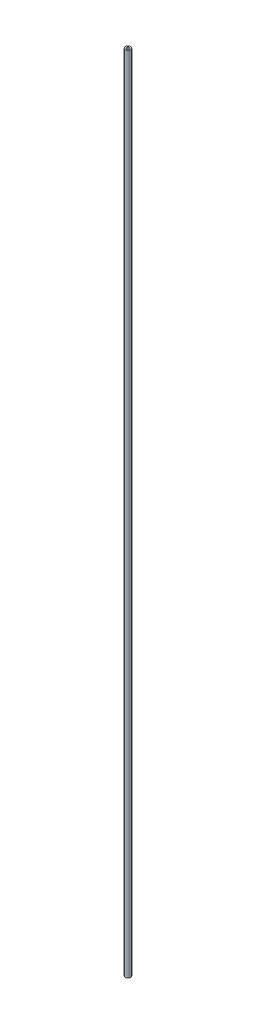
ISO-10303-21;
HEADER;
FILE_DESCRIPTION(('STEP AP214'),'2;1');
FILE_NAME('part.step','',(''),(''),'','','');
FILE_SCHEMA(('AUTOMOTIVE_DESIGN { 1 0 10303 214 1 1 1 1 }'));
ENDSEC;
DATA;
#1=APPLICATION_CONTEXT('core data for automotive mechanical design processes');
#2=APPLICATION_PROTOCOL_DEFINITION('international standard','automotive_design',2000,#1);
#3=PRODUCT_CONTEXT('',#1,'mechanical');
#4=PRODUCT('Part','Part','',(#3));
#5=PRODUCT_RELATED_PRODUCT_CATEGORY('part','',(#4));
#6=PRODUCT_DEFINITION_FORMATION('','',#4);
#7=PRODUCT_DEFINITION_CONTEXT('part definition',#1,'design');
#8=PRODUCT_DEFINITION('design','',#6,#7);
#9=PRODUCT_DEFINITION_SHAPE('','',#8);
#10=(LENGTH_UNIT() NAMED_UNIT(*) SI_UNIT(.MILLI.,.METRE.));
#11=(NAMED_UNIT(*) PLANE_ANGLE_UNIT() SI_UNIT($,.RADIAN.));
#12=(NAMED_UNIT(*) SI_UNIT($,.STERADIAN.) SOLID_ANGLE_UNIT());
#13=UNCERTAINTY_MEASURE_WITH_UNIT(LENGTH_MEASURE(1.E-05),#10,'distance_accuracy_value','');
#14=(GEOMETRIC_REPRESENTATION_CONTEXT(3) GLOBAL_UNCERTAINTY_ASSIGNED_CONTEXT((#13)) GLOBAL_UNIT_ASSIGNED_CONTEXT((#10,
#11,#12)) REPRESENTATION_CONTEXT('',''));
#15=CARTESIAN_POINT('',(0.,0.,0.));
#16=DIRECTION('',(0.,0.,1.));
#17=DIRECTION('',(1.,0.,0.));
#18=AXIS2_PLACEMENT_3D('',#15,#16,#17);
#19=CARTESIAN_POINT('',(0.,-150.,0.));
#20=DIRECTION('',(0.,1.,0.));
#21=DIRECTION('',(0.,0.,1.));
#22=AXIS2_PLACEMENT_3D('',#19,#20,#21);
#23=CYLINDRICAL_SURFACE('',#22,1.);
#24=CARTESIAN_POINT('',(0.,-150.,0.));
#25=DIRECTION('',(0.,1.,0.));
#26=DIRECTION('',(0.,0.,1.));
#27=AXIS2_PLACEMENT_3D('',#24,#25,#26);
#28=CIRCLE('',#27,1.);
#29=CARTESIAN_POINT('',(0.,-150.,1.));
#30=VERTEX_POINT('',#29);
#31=EDGE_CURVE('E10',#30,#30,#28,.T.);
#32=ORIENTED_EDGE('',*,*,#31,.T.);
#33=EDGE_LOOP('',(#32));
#34=FACE_BOUND('',#33,.T.);
#35=CARTESIAN_POINT('',(0.,150.,0.));
#36=DIRECTION('',(0.,1.,0.));
#37=DIRECTION('',(0.,0.,1.));
#38=AXIS2_PLACEMENT_3D('',#35,#36,#37);
#39=CIRCLE('',#38,1.);
#40=CARTESIAN_POINT('',(0.,150.,1.));
#41=VERTEX_POINT('',#40);
#42=EDGE_CURVE('E49',#41,#41,#39,.T.);
#43=ORIENTED_EDGE('',*,*,#42,.F.);
#44=EDGE_LOOP('',(#43));
#45=FACE_BOUND('',#44,.T.);
#46=ADVANCED_FACE('F37',(#34,#45),#23,.T.);
#47=CARTESIAN_POINT('',(0.,-150.,0.));
#48=DIRECTION('',(0.,1.,0.));
#49=DIRECTION('',(0.,0.,1.));
#50=AXIS2_PLACEMENT_3D('',#47,#48,#49);
#51=PLANE('',#50);
#52=CARTESIAN_POINT('',(0.,-150.,0.));
#53=DIRECTION('',(0.,1.,0.));
#54=DIRECTION('',(0.,0.,1.));
#55=AXIS2_PLACEMENT_3D('',#52,#53,#54);
#56=CIRCLE('',#55,0.5);
#57=CARTESIAN_POINT('',(0.,-150.,0.5));
#58=VERTEX_POINT('',#57);
#59=EDGE_CURVE('E44',#58,#58,#56,.T.);
#60=ORIENTED_EDGE('',*,*,#59,.T.);
#61=EDGE_LOOP('',(#60));
#62=FACE_BOUND('',#61,.T.);
#63=ORIENTED_EDGE('',*,*,#31,.F.);
#64=EDGE_LOOP('',(#63));
#65=FACE_BOUND('',#64,.T.);
#66=ADVANCED_FACE('F70',(#62,#65),#51,.F.);
#67=CARTESIAN_POINT('',(0.,-150.,0.));
#68=DIRECTION('',(0.,1.,0.));
#69=DIRECTION('',(0.,0.,1.));
#70=AXIS2_PLACEMENT_3D('',#67,#68,#69);
#71=CYLINDRICAL_SURFACE('',#70,0.5);
#72=ORIENTED_EDGE('',*,*,#59,.F.);
#73=EDGE_LOOP('',(#72));
#74=FACE_BOUND('',#73,.T.);
#75=CARTESIAN_POINT('',(0.,150.,0.));
#76=DIRECTION('',(0.,1.,0.));
#77=DIRECTION('',(0.,0.,1.));
#78=AXIS2_PLACEMENT_3D('',#75,#76,#77);
#79=CIRCLE('',#78,0.5);
#80=CARTESIAN_POINT('',(0.,150.,0.5));
#81=VERTEX_POINT('',#80);
#82=EDGE_CURVE('E54',#81,#81,#79,.T.);
#83=ORIENTED_EDGE('',*,*,#82,.T.);
#84=EDGE_LOOP('',(#83));
#85=FACE_BOUND('',#84,.T.);
#86=ADVANCED_FACE('F61',(#74,#85),#71,.F.);
#87=CARTESIAN_POINT('',(0.,150.,0.));
#88=DIRECTION('',(0.,1.,0.));
#89=DIRECTION('',(0.,0.,1.));
#90=AXIS2_PLACEMENT_3D('',#87,#88,#89);
#91=PLANE('',#90);
#92=ORIENTED_EDGE('',*,*,#42,.T.);
#93=EDGE_LOOP('',(#92));
#94=FACE_BOUND('',#93,.T.);
#95=ORIENTED_EDGE('',*,*,#82,.F.);
#96=EDGE_LOOP('',(#95));
#97=FACE_BOUND('',#96,.T.);
#98=ADVANCED_FACE('F63',(#94,#97),#91,.T.);
#99=CLOSED_SHELL('',(#46,#66,#86,#98));
#100=MANIFOLD_SOLID_BREP('B2',#99);
#101=ADVANCED_BREP_SHAPE_REPRESENTATION('',(#18,#100),#14);
#102=SHAPE_DEFINITION_REPRESENTATION(#9,#101);
ENDSEC;
END-ISO-10303-21;
